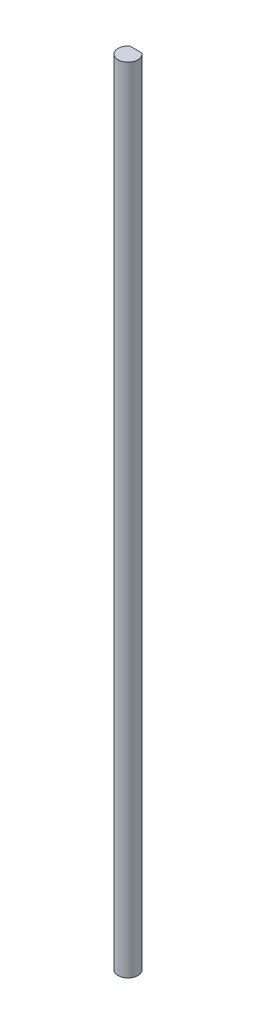
ISO-10303-21;
HEADER;
FILE_DESCRIPTION(('STEP AP214'),'2;1');
FILE_NAME('part.step','',(''),(''),'','','');
FILE_SCHEMA(('AUTOMOTIVE_DESIGN { 1 0 10303 214 1 1 1 1 }'));
ENDSEC;
DATA;
#1=APPLICATION_CONTEXT('core data for automotive mechanical design processes');
#2=APPLICATION_PROTOCOL_DEFINITION('international standard','automotive_design',2000,#1);
#3=PRODUCT_CONTEXT('',#1,'mechanical');
#4=PRODUCT('Part','Part','',(#3));
#5=PRODUCT_RELATED_PRODUCT_CATEGORY('part','',(#4));
#6=PRODUCT_DEFINITION_FORMATION('','',#4);
#7=PRODUCT_DEFINITION_CONTEXT('part definition',#1,'design');
#8=PRODUCT_DEFINITION('design','',#6,#7);
#9=PRODUCT_DEFINITION_SHAPE('','',#8);
#10=(LENGTH_UNIT() NAMED_UNIT(*) SI_UNIT(.MILLI.,.METRE.));
#11=(NAMED_UNIT(*) PLANE_ANGLE_UNIT() SI_UNIT($,.RADIAN.));
#12=(NAMED_UNIT(*) SI_UNIT($,.STERADIAN.) SOLID_ANGLE_UNIT());
#13=UNCERTAINTY_MEASURE_WITH_UNIT(LENGTH_MEASURE(1.E-05),#10,'distance_accuracy_value','');
#14=(GEOMETRIC_REPRESENTATION_CONTEXT(3) GLOBAL_UNCERTAINTY_ASSIGNED_CONTEXT((#13)) GLOBAL_UNIT_ASSIGNED_CONTEXT((#10,
#11,#12)) REPRESENTATION_CONTEXT('',''));
#15=CARTESIAN_POINT('',(0.,0.,0.));
#16=DIRECTION('',(0.,0.,1.));
#17=DIRECTION('',(1.,0.,0.));
#18=AXIS2_PLACEMENT_3D('',#15,#16,#17);
#19=CARTESIAN_POINT('',(0.,254.,0.));
#20=DIRECTION('',(0.,-1.,0.));
#21=DIRECTION('',(0.,0.,-1.));
#22=AXIS2_PLACEMENT_3D('',#19,#20,#21);
#23=CYLINDRICAL_SURFACE('',#22,3.175);
#24=CARTESIAN_POINT('',(0.,0.,0.));
#25=DIRECTION('',(0.,1.,0.));
#26=DIRECTION('',(0.,0.,1.));
#27=AXIS2_PLACEMENT_3D('',#24,#25,#26);
#28=CIRCLE('',#27,3.175);
#29=CARTESIAN_POINT('',(-1.905,0.,-2.54));
#30=VERTEX_POINT('',#29);
#31=CARTESIAN_POINT('',(1.905,0.,-2.54));
#32=VERTEX_POINT('',#31);
#33=EDGE_CURVE('E64',#30,#32,#28,.T.);
#34=ORIENTED_EDGE('',*,*,#33,.T.);
#35=DIRECTION('',(0.,-1.,0.));
#36=VECTOR('',#35,1.);
#37=CARTESIAN_POINT('',(1.905,254.,-2.54));
#38=LINE('',#37,#36);
#39=CARTESIAN_POINT('',(1.905,254.,-2.54));
#40=VERTEX_POINT('',#39);
#41=EDGE_CURVE('E11',#40,#32,#38,.T.);
#42=ORIENTED_EDGE('',*,*,#41,.F.);
#43=CARTESIAN_POINT('',(0.,254.,0.));
#44=DIRECTION('',(0.,1.,0.));
#45=DIRECTION('',(0.,0.,1.));
#46=AXIS2_PLACEMENT_3D('',#43,#44,#45);
#47=CIRCLE('',#46,3.175);
#48=CARTESIAN_POINT('',(-1.905,254.,-2.54));
#49=VERTEX_POINT('',#48);
#50=EDGE_CURVE('E63',#49,#40,#47,.T.);
#51=ORIENTED_EDGE('',*,*,#50,.F.);
#52=DIRECTION('',(0.,-1.,0.));
#53=VECTOR('',#52,1.);
#54=CARTESIAN_POINT('',(-1.905,254.,-2.54));
#55=LINE('',#54,#53);
#56=EDGE_CURVE('E41',#49,#30,#55,.T.);
#57=ORIENTED_EDGE('',*,*,#56,.T.);
#58=EDGE_LOOP('',(#34,#42,#51,#57));
#59=FACE_BOUND('',#58,.T.);
#60=ADVANCED_FACE('F33',(#59),#23,.T.);
#61=CARTESIAN_POINT('',(-1.905,254.,-2.54));
#62=DIRECTION('',(0.,0.,1.));
#63=DIRECTION('',(1.,0.,0.));
#64=AXIS2_PLACEMENT_3D('',#61,#62,#63);
#65=PLANE('',#64);
#66=DIRECTION('',(-1.,0.,0.));
#67=VECTOR('',#66,1.);
#68=CARTESIAN_POINT('',(-1.905,0.,-2.54));
#69=LINE('',#68,#67);
#70=EDGE_CURVE('E56',#32,#30,#69,.T.);
#71=ORIENTED_EDGE('',*,*,#70,.T.);
#72=ORIENTED_EDGE('',*,*,#56,.F.);
#73=DIRECTION('',(-1.,0.,0.));
#74=VECTOR('',#73,1.);
#75=CARTESIAN_POINT('',(-1.905,254.,-2.54));
#76=LINE('',#75,#74);
#77=EDGE_CURVE('E48',#40,#49,#76,.T.);
#78=ORIENTED_EDGE('',*,*,#77,.F.);
#79=ORIENTED_EDGE('',*,*,#41,.T.);
#80=EDGE_LOOP('',(#71,#72,#78,#79));
#81=FACE_BOUND('',#80,.T.);
#82=ADVANCED_FACE('F59',(#81),#65,.F.);
#83=CARTESIAN_POINT('',(0.,254.,0.));
#84=DIRECTION('',(0.,1.,0.));
#85=DIRECTION('',(0.,0.,1.));
#86=AXIS2_PLACEMENT_3D('',#83,#84,#85);
#87=PLANE('',#86);
#88=ORIENTED_EDGE('',*,*,#50,.T.);
#89=ORIENTED_EDGE('',*,*,#77,.T.);
#90=EDGE_LOOP('',(#88,#89));
#91=FACE_BOUND('',#90,.T.);
#92=ADVANCED_FACE('F71',(#91),#87,.T.);
#93=CARTESIAN_POINT('',(0.,0.,0.));
#94=DIRECTION('',(0.,1.,0.));
#95=DIRECTION('',(0.,0.,1.));
#96=AXIS2_PLACEMENT_3D('',#93,#94,#95);
#97=PLANE('',#96);
#98=ORIENTED_EDGE('',*,*,#33,.F.);
#99=ORIENTED_EDGE('',*,*,#70,.F.);
#100=EDGE_LOOP('',(#98,#99));
#101=FACE_BOUND('',#100,.T.);
#102=ADVANCED_FACE('F67',(#101),#97,.F.);
#103=CLOSED_SHELL('',(#60,#82,#92,#102));
#104=MANIFOLD_SOLID_BREP('B2',#103);
#105=ADVANCED_BREP_SHAPE_REPRESENTATION('',(#18,#104),#14);
#106=SHAPE_DEFINITION_REPRESENTATION(#9,#105);
ENDSEC;
END-ISO-10303-21;
